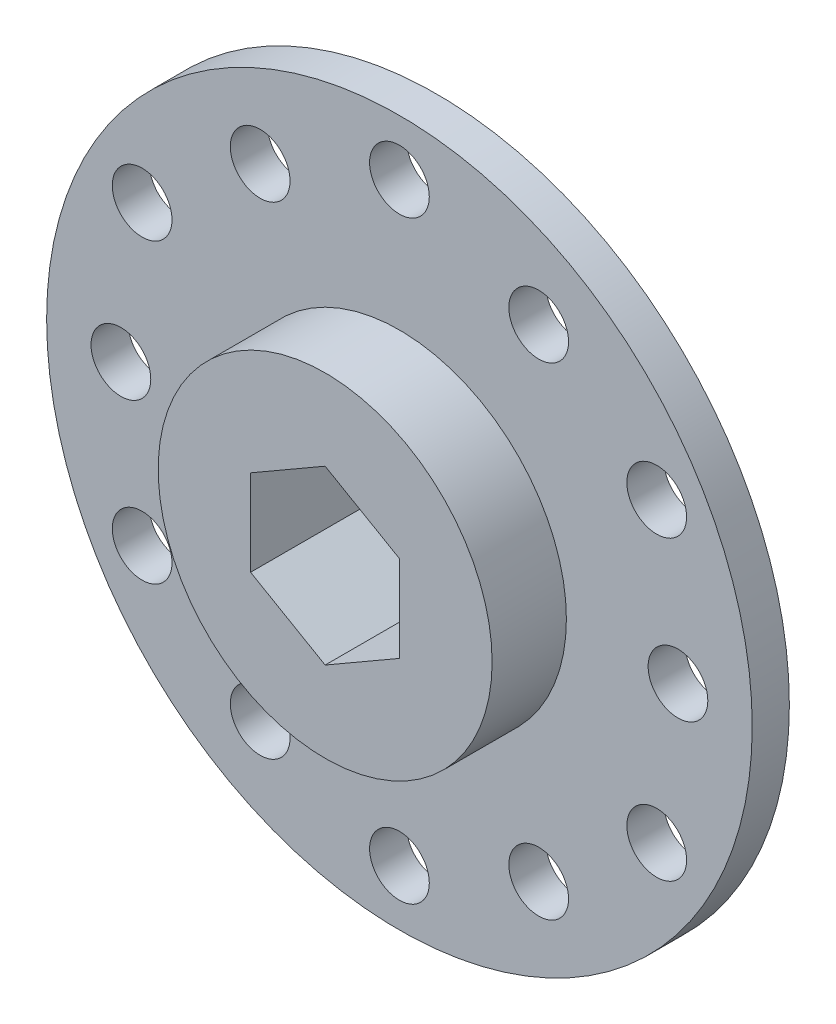
ISO-10303-21;
HEADER;
FILE_DESCRIPTION(('STEP AP214'),'2;1');
FILE_NAME('part.step','',(''),(''),'','','');
FILE_SCHEMA(('AUTOMOTIVE_DESIGN { 1 0 10303 214 1 1 1 1 }'));
ENDSEC;
DATA;
#1=APPLICATION_CONTEXT('core data for automotive mechanical design processes');
#2=APPLICATION_PROTOCOL_DEFINITION('international standard','automotive_design',2000,#1);
#3=PRODUCT_CONTEXT('',#1,'mechanical');
#4=PRODUCT('Part','Part','',(#3));
#5=PRODUCT_RELATED_PRODUCT_CATEGORY('part','',(#4));
#6=PRODUCT_DEFINITION_FORMATION('','',#4);
#7=PRODUCT_DEFINITION_CONTEXT('part definition',#1,'design');
#8=PRODUCT_DEFINITION('design','',#6,#7);
#9=PRODUCT_DEFINITION_SHAPE('','',#8);
#10=(LENGTH_UNIT() NAMED_UNIT(*) SI_UNIT(.MILLI.,.METRE.));
#11=(NAMED_UNIT(*) PLANE_ANGLE_UNIT() SI_UNIT($,.RADIAN.));
#12=(NAMED_UNIT(*) SI_UNIT($,.STERADIAN.) SOLID_ANGLE_UNIT());
#13=UNCERTAINTY_MEASURE_WITH_UNIT(LENGTH_MEASURE(1.E-05),#10,'distance_accuracy_value','');
#14=(GEOMETRIC_REPRESENTATION_CONTEXT(3) GLOBAL_UNCERTAINTY_ASSIGNED_CONTEXT((#13)) GLOBAL_UNIT_ASSIGNED_CONTEXT((#10,
#11,#12)) REPRESENTATION_CONTEXT('',''));
#15=CARTESIAN_POINT('',(0.,0.,0.));
#16=DIRECTION('',(0.,0.,1.));
#17=DIRECTION('',(1.,0.,0.));
#18=AXIS2_PLACEMENT_3D('',#15,#16,#17);
#19=CARTESIAN_POINT('',(0.,0.,0.));
#20=DIRECTION('',(0.,0.,1.));
#21=DIRECTION('',(1.,0.,0.));
#22=AXIS2_PLACEMENT_3D('',#19,#20,#21);
#23=CYLINDRICAL_SURFACE('',#22,30.1625);
#24=CARTESIAN_POINT('',(0.,0.,0.));
#25=DIRECTION('',(0.,0.,1.));
#26=DIRECTION('',(1.,0.,0.));
#27=AXIS2_PLACEMENT_3D('',#24,#25,#26);
#28=CIRCLE('',#27,30.1625);
#29=CARTESIAN_POINT('',(30.1625,0.,0.));
#30=VERTEX_POINT('',#29);
#31=EDGE_CURVE('E54',#30,#30,#28,.T.);
#32=ORIENTED_EDGE('',*,*,#31,.T.);
#33=EDGE_LOOP('',(#32));
#34=FACE_BOUND('',#33,.T.);
#35=CARTESIAN_POINT('',(0.,0.,3.175));
#36=DIRECTION('',(0.,0.,1.));
#37=DIRECTION('',(1.,0.,0.));
#38=AXIS2_PLACEMENT_3D('',#35,#36,#37);
#39=CIRCLE('',#38,30.1625);
#40=CARTESIAN_POINT('',(30.1625,0.,3.175));
#41=VERTEX_POINT('',#40);
#42=EDGE_CURVE('E176',#41,#41,#39,.T.);
#43=ORIENTED_EDGE('',*,*,#42,.F.);
#44=EDGE_LOOP('',(#43));
#45=FACE_BOUND('',#44,.T.);
#46=ADVANCED_FACE('F45',(#34,#45),#23,.T.);
#47=CARTESIAN_POINT('',(30.1625,0.,0.));
#48=DIRECTION('',(0.,0.,-1.));
#49=DIRECTION('',(-1.,0.,0.));
#50=AXIS2_PLACEMENT_3D('',#47,#48,#49);
#51=PLANE('',#50);
#52=CARTESIAN_POINT('',(-11.90625,20.6222299276169,0.));
#53=DIRECTION('',(0.,0.,-1.));
#54=DIRECTION('',(-1.,0.,0.));
#55=AXIS2_PLACEMENT_3D('',#52,#53,#54);
#56=CIRCLE('',#55,2.55270000000001);
#57=CARTESIAN_POINT('',(-14.45895,20.6222299276169,0.));
#58=VERTEX_POINT('',#57);
#59=EDGE_CURVE('E358',#58,#58,#56,.T.);
#60=ORIENTED_EDGE('',*,*,#59,.F.);
#61=EDGE_LOOP('',(#60));
#62=FACE_BOUND('',#61,.T.);
#63=CARTESIAN_POINT('',(0.,25.4,0.));
#64=DIRECTION('',(0.,0.,-1.));
#65=DIRECTION('',(-1.,0.,0.));
#66=AXIS2_PLACEMENT_3D('',#63,#64,#65);
#67=CIRCLE('',#66,2.55270000000001);
#68=CARTESIAN_POINT('',(-2.55270000000001,25.4,0.));
#69=VERTEX_POINT('',#68);
#70=EDGE_CURVE('E362',#69,#69,#67,.T.);
#71=ORIENTED_EDGE('',*,*,#70,.F.);
#72=EDGE_LOOP('',(#71));
#73=FACE_BOUND('',#72,.T.);
#74=CARTESIAN_POINT('',(-23.8125,0.,0.));
#75=DIRECTION('',(0.,0.,-1.));
#76=DIRECTION('',(-1.,0.,0.));
#77=AXIS2_PLACEMENT_3D('',#74,#75,#76);
#78=CIRCLE('',#77,2.55270000000001);
#79=CARTESIAN_POINT('',(-26.3652,0.,0.));
#80=VERTEX_POINT('',#79);
#81=EDGE_CURVE('E372',#80,#80,#78,.T.);
#82=ORIENTED_EDGE('',*,*,#81,.F.);
#83=EDGE_LOOP('',(#82));
#84=FACE_BOUND('',#83,.T.);
#85=CARTESIAN_POINT('',(-21.9970452561247,12.7,0.));
#86=DIRECTION('',(0.,0.,-1.));
#87=DIRECTION('',(-1.,0.,0.));
#88=AXIS2_PLACEMENT_3D('',#85,#86,#87);
#89=CIRCLE('',#88,2.55270000000001);
#90=CARTESIAN_POINT('',(-24.5497452561248,12.7,0.));
#91=VERTEX_POINT('',#90);
#92=EDGE_CURVE('E218',#91,#91,#89,.T.);
#93=ORIENTED_EDGE('',*,*,#92,.F.);
#94=EDGE_LOOP('',(#93));
#95=FACE_BOUND('',#94,.T.);
#96=CARTESIAN_POINT('',(-11.90625,-20.6222299276169,0.));
#97=DIRECTION('',(0.,0.,-1.));
#98=DIRECTION('',(-1.,0.,0.));
#99=AXIS2_PLACEMENT_3D('',#96,#97,#98);
#100=CIRCLE('',#99,2.55270000000001);
#101=CARTESIAN_POINT('',(-14.45895,-20.6222299276169,0.));
#102=VERTEX_POINT('',#101);
#103=EDGE_CURVE('E203',#102,#102,#100,.T.);
#104=ORIENTED_EDGE('',*,*,#103,.F.);
#105=EDGE_LOOP('',(#104));
#106=FACE_BOUND('',#105,.T.);
#107=CARTESIAN_POINT('',(-21.9970452561247,-12.7,0.));
#108=DIRECTION('',(0.,0.,-1.));
#109=DIRECTION('',(-1.,0.,0.));
#110=AXIS2_PLACEMENT_3D('',#107,#108,#109);
#111=CIRCLE('',#110,2.55270000000001);
#112=CARTESIAN_POINT('',(-24.5497452561248,-12.7,0.));
#113=VERTEX_POINT('',#112);
#114=EDGE_CURVE('E202',#113,#113,#111,.T.);
#115=ORIENTED_EDGE('',*,*,#114,.F.);
#116=EDGE_LOOP('',(#115));
#117=FACE_BOUND('',#116,.T.);
#118=CARTESIAN_POINT('',(11.90625,-20.6222299276169,0.));
#119=DIRECTION('',(0.,0.,-1.));
#120=DIRECTION('',(-1.,0.,0.));
#121=AXIS2_PLACEMENT_3D('',#118,#119,#120);
#122=CIRCLE('',#121,2.55270000000001);
#123=CARTESIAN_POINT('',(9.35354999999999,-20.6222299276169,0.));
#124=VERTEX_POINT('',#123);
#125=EDGE_CURVE('E198',#124,#124,#122,.T.);
#126=ORIENTED_EDGE('',*,*,#125,.F.);
#127=EDGE_LOOP('',(#126));
#128=FACE_BOUND('',#127,.T.);
#129=CARTESIAN_POINT('',(0.,-25.4,0.));
#130=DIRECTION('',(0.,0.,-1.));
#131=DIRECTION('',(-1.,0.,0.));
#132=AXIS2_PLACEMENT_3D('',#129,#130,#131);
#133=CIRCLE('',#132,2.55270000000001);
#134=CARTESIAN_POINT('',(-2.55270000000002,-25.4,0.));
#135=VERTEX_POINT('',#134);
#136=EDGE_CURVE('E194',#135,#135,#133,.T.);
#137=ORIENTED_EDGE('',*,*,#136,.F.);
#138=EDGE_LOOP('',(#137));
#139=FACE_BOUND('',#138,.T.);
#140=CARTESIAN_POINT('',(23.8125,0.,0.));
#141=DIRECTION('',(0.,0.,-1.));
#142=DIRECTION('',(-1.,0.,0.));
#143=AXIS2_PLACEMENT_3D('',#140,#141,#142);
#144=CIRCLE('',#143,2.55270000000001);
#145=CARTESIAN_POINT('',(21.2598,0.,0.));
#146=VERTEX_POINT('',#145);
#147=EDGE_CURVE('E189',#146,#146,#144,.T.);
#148=ORIENTED_EDGE('',*,*,#147,.F.);
#149=EDGE_LOOP('',(#148));
#150=FACE_BOUND('',#149,.T.);
#151=CARTESIAN_POINT('',(21.9970452561247,-12.7,0.));
#152=DIRECTION('',(0.,0.,-1.));
#153=DIRECTION('',(-1.,0.,0.));
#154=AXIS2_PLACEMENT_3D('',#151,#152,#153);
#155=CIRCLE('',#154,2.55270000000001);
#156=CARTESIAN_POINT('',(19.4443452561247,-12.7,0.));
#157=VERTEX_POINT('',#156);
#158=EDGE_CURVE('E188',#157,#157,#155,.T.);
#159=ORIENTED_EDGE('',*,*,#158,.F.);
#160=EDGE_LOOP('',(#159));
#161=FACE_BOUND('',#160,.T.);
#162=CARTESIAN_POINT('',(11.90625,20.6222299276169,0.));
#163=DIRECTION('',(0.,0.,-1.));
#164=DIRECTION('',(-1.,0.,0.));
#165=AXIS2_PLACEMENT_3D('',#162,#163,#164);
#166=CIRCLE('',#165,2.55270000000001);
#167=CARTESIAN_POINT('',(9.35354999999999,20.6222299276169,0.));
#168=VERTEX_POINT('',#167);
#169=EDGE_CURVE('E241',#168,#168,#166,.T.);
#170=ORIENTED_EDGE('',*,*,#169,.F.);
#171=EDGE_LOOP('',(#170));
#172=FACE_BOUND('',#171,.T.);
#173=CARTESIAN_POINT('',(21.9970452561247,12.7,0.));
#174=DIRECTION('',(0.,0.,-1.));
#175=DIRECTION('',(-1.,0.,0.));
#176=AXIS2_PLACEMENT_3D('',#173,#174,#175);
#177=CIRCLE('',#176,2.55270000000001);
#178=CARTESIAN_POINT('',(19.4443452561247,12.7,0.));
#179=VERTEX_POINT('',#178);
#180=EDGE_CURVE('E248',#179,#179,#177,.T.);
#181=ORIENTED_EDGE('',*,*,#180,.F.);
#182=EDGE_LOOP('',(#181));
#183=FACE_BOUND('',#182,.T.);
#184=DIRECTION('',(0.866025403784439,-0.5,0.));
#185=VECTOR('',#184,1.);
#186=CARTESIAN_POINT('',(-6.3754,-3.68083890619154,0.));
#187=LINE('',#186,#185);
#188=CARTESIAN_POINT('',(-6.3754,-3.68083890619154,0.));
#189=VERTEX_POINT('',#188);
#190=CARTESIAN_POINT('',(0.,-7.36167781238308,0.));
#191=VERTEX_POINT('',#190);
#192=EDGE_CURVE('E102',#189,#191,#187,.T.);
#193=ORIENTED_EDGE('',*,*,#192,.T.);
#194=DIRECTION('',(0.866025403784439,0.5,0.));
#195=VECTOR('',#194,1.);
#196=CARTESIAN_POINT('',(0.,-7.36167781238308,0.));
#197=LINE('',#196,#195);
#198=CARTESIAN_POINT('',(6.3754,-3.68083890619154,0.));
#199=VERTEX_POINT('',#198);
#200=EDGE_CURVE('E112',#191,#199,#197,.T.);
#201=ORIENTED_EDGE('',*,*,#200,.T.);
#202=DIRECTION('',(0.,1.,0.));
#203=VECTOR('',#202,1.);
#204=CARTESIAN_POINT('',(6.3754,-3.68083890619154,0.));
#205=LINE('',#204,#203);
#206=CARTESIAN_POINT('',(6.3754,3.68083890619154,0.));
#207=VERTEX_POINT('',#206);
#208=EDGE_CURVE('E62',#199,#207,#205,.T.);
#209=ORIENTED_EDGE('',*,*,#208,.T.);
#210=DIRECTION('',(-0.866025403784439,0.5,0.));
#211=VECTOR('',#210,1.);
#212=CARTESIAN_POINT('',(6.3754,3.68083890619154,0.));
#213=LINE('',#212,#211);
#214=CARTESIAN_POINT('',(0.,7.36167781238308,0.));
#215=VERTEX_POINT('',#214);
#216=EDGE_CURVE('E134',#207,#215,#213,.T.);
#217=ORIENTED_EDGE('',*,*,#216,.T.);
#218=DIRECTION('',(-0.866025403784438,-0.500000000000001,0.));
#219=VECTOR('',#218,1.);
#220=CARTESIAN_POINT('',(0.,7.36167781238308,0.));
#221=LINE('',#220,#219);
#222=CARTESIAN_POINT('',(-6.3754,3.68083890619154,0.));
#223=VERTEX_POINT('',#222);
#224=EDGE_CURVE('E138',#215,#223,#221,.T.);
#225=ORIENTED_EDGE('',*,*,#224,.T.);
#226=DIRECTION('',(0.,-1.,0.));
#227=VECTOR('',#226,1.);
#228=CARTESIAN_POINT('',(-6.3754,3.68083890619154,0.));
#229=LINE('',#228,#227);
#230=EDGE_CURVE('E109',#223,#189,#229,.T.);
#231=ORIENTED_EDGE('',*,*,#230,.T.);
#232=EDGE_LOOP('',(#193,#201,#209,#217,#225,#231));
#233=FACE_BOUND('',#232,.T.);
#234=ORIENTED_EDGE('',*,*,#31,.F.);
#235=EDGE_LOOP('',(#234));
#236=FACE_BOUND('',#235,.T.);
#237=ADVANCED_FACE('F117',(#62,#73,#84,#95,#106,#117,#128,#139,#150,#161,#172,#183,#233,#236),
#51,.T.);
#238=CARTESIAN_POINT('',(0.,0.,3.175));
#239=DIRECTION('',(0.,0.,1.));
#240=DIRECTION('',(1.,0.,0.));
#241=AXIS2_PLACEMENT_3D('',#238,#239,#240);
#242=PLANE('',#241);
#243=CARTESIAN_POINT('',(-11.90625,20.6222299276169,3.175));
#244=DIRECTION('',(0.,0.,1.));
#245=DIRECTION('',(1.,0.,0.));
#246=AXIS2_PLACEMENT_3D('',#243,#244,#245);
#247=CIRCLE('',#246,2.55270000000001);
#248=CARTESIAN_POINT('',(-9.35354999999999,20.6222299276169,3.175));
#249=VERTEX_POINT('',#248);
#250=EDGE_CURVE('E356',#249,#249,#247,.T.);
#251=ORIENTED_EDGE('',*,*,#250,.F.);
#252=EDGE_LOOP('',(#251));
#253=FACE_BOUND('',#252,.T.);
#254=CARTESIAN_POINT('',(0.,25.4,3.175));
#255=DIRECTION('',(0.,0.,1.));
#256=DIRECTION('',(1.,0.,0.));
#257=AXIS2_PLACEMENT_3D('',#254,#255,#256);
#258=CIRCLE('',#257,2.55270000000001);
#259=CARTESIAN_POINT('',(2.55270000000001,25.4,3.175));
#260=VERTEX_POINT('',#259);
#261=EDGE_CURVE('E368',#260,#260,#258,.T.);
#262=ORIENTED_EDGE('',*,*,#261,.F.);
#263=EDGE_LOOP('',(#262));
#264=FACE_BOUND('',#263,.T.);
#265=CARTESIAN_POINT('',(-23.8125,0.,3.175));
#266=DIRECTION('',(0.,0.,1.));
#267=DIRECTION('',(1.,0.,0.));
#268=AXIS2_PLACEMENT_3D('',#265,#266,#267);
#269=CIRCLE('',#268,2.55270000000001);
#270=CARTESIAN_POINT('',(-21.2598,0.,3.175));
#271=VERTEX_POINT('',#270);
#272=EDGE_CURVE('E48',#271,#271,#269,.T.);
#273=ORIENTED_EDGE('',*,*,#272,.F.);
#274=EDGE_LOOP('',(#273));
#275=FACE_BOUND('',#274,.T.);
#276=CARTESIAN_POINT('',(-21.9970452561247,12.7,3.175));
#277=DIRECTION('',(0.,0.,1.));
#278=DIRECTION('',(1.,0.,0.));
#279=AXIS2_PLACEMENT_3D('',#276,#277,#278);
#280=CIRCLE('',#279,2.55270000000001);
#281=CARTESIAN_POINT('',(-19.4443452561247,12.7,3.175));
#282=VERTEX_POINT('',#281);
#283=EDGE_CURVE('E212',#282,#282,#280,.T.);
#284=ORIENTED_EDGE('',*,*,#283,.F.);
#285=EDGE_LOOP('',(#284));
#286=FACE_BOUND('',#285,.T.);
#287=CARTESIAN_POINT('',(-11.90625,-20.6222299276169,3.175));
#288=DIRECTION('',(0.,0.,1.));
#289=DIRECTION('',(1.,0.,0.));
#290=AXIS2_PLACEMENT_3D('',#287,#288,#289);
#291=CIRCLE('',#290,2.55270000000001);
#292=CARTESIAN_POINT('',(-9.35354999999999,-20.6222299276169,3.175));
#293=VERTEX_POINT('',#292);
#294=EDGE_CURVE('E199',#293,#293,#291,.T.);
#295=ORIENTED_EDGE('',*,*,#294,.F.);
#296=EDGE_LOOP('',(#295));
#297=FACE_BOUND('',#296,.T.);
#298=CARTESIAN_POINT('',(-21.9970452561247,-12.7,3.175));
#299=DIRECTION('',(0.,0.,1.));
#300=DIRECTION('',(1.,0.,0.));
#301=AXIS2_PLACEMENT_3D('',#298,#299,#300);
#302=CIRCLE('',#301,2.55270000000001);
#303=CARTESIAN_POINT('',(-19.4443452561247,-12.7,3.175));
#304=VERTEX_POINT('',#303);
#305=EDGE_CURVE('E209',#304,#304,#302,.T.);
#306=ORIENTED_EDGE('',*,*,#305,.F.);
#307=EDGE_LOOP('',(#306));
#308=FACE_BOUND('',#307,.T.);
#309=CARTESIAN_POINT('',(11.90625,-20.6222299276169,3.175));
#310=DIRECTION('',(0.,0.,1.));
#311=DIRECTION('',(1.,0.,0.));
#312=AXIS2_PLACEMENT_3D('',#309,#310,#311);
#313=CIRCLE('',#312,2.55270000000001);
#314=CARTESIAN_POINT('',(14.45895,-20.6222299276169,3.175));
#315=VERTEX_POINT('',#314);
#316=EDGE_CURVE('E195',#315,#315,#313,.T.);
#317=ORIENTED_EDGE('',*,*,#316,.F.);
#318=EDGE_LOOP('',(#317));
#319=FACE_BOUND('',#318,.T.);
#320=CARTESIAN_POINT('',(0.,-25.4,3.175));
#321=DIRECTION('',(0.,0.,1.));
#322=DIRECTION('',(1.,0.,0.));
#323=AXIS2_PLACEMENT_3D('',#320,#321,#322);
#324=CIRCLE('',#323,2.55270000000001);
#325=CARTESIAN_POINT('',(2.55270000000001,-25.4,3.175));
#326=VERTEX_POINT('',#325);
#327=EDGE_CURVE('E190',#326,#326,#324,.T.);
#328=ORIENTED_EDGE('',*,*,#327,.F.);
#329=EDGE_LOOP('',(#328));
#330=FACE_BOUND('',#329,.T.);
#331=CARTESIAN_POINT('',(23.8125,0.,3.175));
#332=DIRECTION('',(0.,0.,1.));
#333=DIRECTION('',(1.,0.,0.));
#334=AXIS2_PLACEMENT_3D('',#331,#332,#333);
#335=CIRCLE('',#334,2.55270000000001);
#336=CARTESIAN_POINT('',(26.3652,0.,3.175));
#337=VERTEX_POINT('',#336);
#338=EDGE_CURVE('E184',#337,#337,#335,.T.);
#339=ORIENTED_EDGE('',*,*,#338,.F.);
#340=EDGE_LOOP('',(#339));
#341=FACE_BOUND('',#340,.T.);
#342=CARTESIAN_POINT('',(21.9970452561247,-12.7,3.175));
#343=DIRECTION('',(0.,0.,1.));
#344=DIRECTION('',(1.,0.,0.));
#345=AXIS2_PLACEMENT_3D('',#342,#343,#344);
#346=CIRCLE('',#345,2.55270000000001);
#347=CARTESIAN_POINT('',(24.5497452561248,-12.7,3.175));
#348=VERTEX_POINT('',#347);
#349=EDGE_CURVE('E237',#348,#348,#346,.T.);
#350=ORIENTED_EDGE('',*,*,#349,.F.);
#351=EDGE_LOOP('',(#350));
#352=FACE_BOUND('',#351,.T.);
#353=CARTESIAN_POINT('',(11.90625,20.6222299276169,3.175));
#354=DIRECTION('',(0.,0.,1.));
#355=DIRECTION('',(1.,0.,0.));
#356=AXIS2_PLACEMENT_3D('',#353,#354,#355);
#357=CIRCLE('',#356,2.55270000000001);
#358=CARTESIAN_POINT('',(14.45895,20.6222299276169,3.175));
#359=VERTEX_POINT('',#358);
#360=EDGE_CURVE('E245',#359,#359,#357,.T.);
#361=ORIENTED_EDGE('',*,*,#360,.F.);
#362=EDGE_LOOP('',(#361));
#363=FACE_BOUND('',#362,.T.);
#364=CARTESIAN_POINT('',(21.9970452561247,12.7,3.175));
#365=DIRECTION('',(0.,0.,1.));
#366=DIRECTION('',(1.,0.,0.));
#367=AXIS2_PLACEMENT_3D('',#364,#365,#366);
#368=CIRCLE('',#367,2.55270000000001);
#369=CARTESIAN_POINT('',(24.5497452561248,12.7,3.175));
#370=VERTEX_POINT('',#369);
#371=EDGE_CURVE('E129',#370,#370,#368,.T.);
#372=ORIENTED_EDGE('',*,*,#371,.F.);
#373=EDGE_LOOP('',(#372));
#374=FACE_BOUND('',#373,.T.);
#375=CARTESIAN_POINT('',(0.,0.,3.175));
#376=DIRECTION('',(0.,0.,1.));
#377=DIRECTION('',(1.,0.,0.));
#378=AXIS2_PLACEMENT_3D('',#375,#376,#377);
#379=CIRCLE('',#378,14.2748);
#380=CARTESIAN_POINT('',(14.2748,0.,3.175));
#381=VERTEX_POINT('',#380);
#382=EDGE_CURVE('E11',#381,#381,#379,.T.);
#383=ORIENTED_EDGE('',*,*,#382,.F.);
#384=EDGE_LOOP('',(#383));
#385=FACE_BOUND('',#384,.T.);
#386=ORIENTED_EDGE('',*,*,#42,.T.);
#387=EDGE_LOOP('',(#386));
#388=FACE_BOUND('',#387,.T.);
#389=ADVANCED_FACE('F259',(#253,#264,#275,#286,#297,#308,#319,#330,#341,#352,#363,#374,#385,
#388),#242,.T.);
#390=CARTESIAN_POINT('',(0.,0.,9.525));
#391=DIRECTION('',(0.,0.,-1.));
#392=DIRECTION('',(-1.,0.,0.));
#393=AXIS2_PLACEMENT_3D('',#390,#391,#392);
#394=CYLINDRICAL_SURFACE('',#393,14.2748);
#395=CARTESIAN_POINT('',(0.,0.,9.525));
#396=DIRECTION('',(0.,0.,1.));
#397=DIRECTION('',(1.,0.,0.));
#398=AXIS2_PLACEMENT_3D('',#395,#396,#397);
#399=CIRCLE('',#398,14.2748);
#400=CARTESIAN_POINT('',(14.2748,0.,9.525));
#401=VERTEX_POINT('',#400);
#402=EDGE_CURVE('E162',#401,#401,#399,.T.);
#403=ORIENTED_EDGE('',*,*,#402,.F.);
#404=EDGE_LOOP('',(#403));
#405=FACE_BOUND('',#404,.T.);
#406=ORIENTED_EDGE('',*,*,#382,.T.);
#407=EDGE_LOOP('',(#406));
#408=FACE_BOUND('',#407,.T.);
#409=ADVANCED_FACE('F262',(#405,#408),#394,.T.);
#410=CARTESIAN_POINT('',(0.,0.,9.525));
#411=DIRECTION('',(0.,0.,1.));
#412=DIRECTION('',(1.,0.,0.));
#413=AXIS2_PLACEMENT_3D('',#410,#411,#412);
#414=PLANE('',#413);
#415=DIRECTION('',(0.866025403784439,-0.5,0.));
#416=VECTOR('',#415,1.);
#417=CARTESIAN_POINT('',(-6.3754,-3.68083890619154,9.525));
#418=LINE('',#417,#416);
#419=CARTESIAN_POINT('',(-6.3754,-3.68083890619154,9.525));
#420=VERTEX_POINT('',#419);
#421=CARTESIAN_POINT('',(0.,-7.36167781238308,9.525));
#422=VERTEX_POINT('',#421);
#423=EDGE_CURVE('E70',#420,#422,#418,.T.);
#424=ORIENTED_EDGE('',*,*,#423,.F.);
#425=DIRECTION('',(0.,-1.,0.));
#426=VECTOR('',#425,1.);
#427=CARTESIAN_POINT('',(-6.3754,3.68083890619154,9.525));
#428=LINE('',#427,#426);
#429=CARTESIAN_POINT('',(-6.3754,3.68083890619154,9.525));
#430=VERTEX_POINT('',#429);
#431=EDGE_CURVE('E122',#430,#420,#428,.T.);
#432=ORIENTED_EDGE('',*,*,#431,.F.);
#433=DIRECTION('',(-0.866025403784438,-0.500000000000001,0.));
#434=VECTOR('',#433,1.);
#435=CARTESIAN_POINT('',(0.,7.36167781238308,9.525));
#436=LINE('',#435,#434);
#437=CARTESIAN_POINT('',(0.,7.36167781238308,9.525));
#438=VERTEX_POINT('',#437);
#439=EDGE_CURVE('E126',#438,#430,#436,.T.);
#440=ORIENTED_EDGE('',*,*,#439,.F.);
#441=DIRECTION('',(-0.866025403784439,0.5,0.));
#442=VECTOR('',#441,1.);
#443=CARTESIAN_POINT('',(6.3754,3.68083890619154,9.525));
#444=LINE('',#443,#442);
#445=CARTESIAN_POINT('',(6.3754,3.68083890619154,9.525));
#446=VERTEX_POINT('',#445);
#447=EDGE_CURVE('E152',#446,#438,#444,.T.);
#448=ORIENTED_EDGE('',*,*,#447,.F.);
#449=DIRECTION('',(0.,1.,0.));
#450=VECTOR('',#449,1.);
#451=CARTESIAN_POINT('',(6.3754,-3.68083890619154,9.525));
#452=LINE('',#451,#450);
#453=CARTESIAN_POINT('',(6.3754,-3.68083890619154,9.525));
#454=VERTEX_POINT('',#453);
#455=EDGE_CURVE('E148',#454,#446,#452,.T.);
#456=ORIENTED_EDGE('',*,*,#455,.F.);
#457=DIRECTION('',(0.866025403784439,0.5,0.));
#458=VECTOR('',#457,1.);
#459=CARTESIAN_POINT('',(0.,-7.36167781238308,9.525));
#460=LINE('',#459,#458);
#461=EDGE_CURVE('E145',#422,#454,#460,.T.);
#462=ORIENTED_EDGE('',*,*,#461,.F.);
#463=EDGE_LOOP('',(#424,#432,#440,#448,#456,#462));
#464=FACE_BOUND('',#463,.T.);
#465=ORIENTED_EDGE('',*,*,#402,.T.);
#466=EDGE_LOOP('',(#465));
#467=FACE_BOUND('',#466,.T.);
#468=ADVANCED_FACE('F284',(#464,#467),#414,.T.);
#469=CARTESIAN_POINT('',(-6.3754,-3.68083890619154,0.));
#470=DIRECTION('',(-0.5,-0.866025403784439,0.));
#471=DIRECTION('',(0.866025403784438,-0.5,0.));
#472=AXIS2_PLACEMENT_3D('',#469,#470,#471);
#473=PLANE('',#472);
#474=ORIENTED_EDGE('',*,*,#423,.T.);
#475=DIRECTION('',(0.,0.,1.));
#476=VECTOR('',#475,1.);
#477=CARTESIAN_POINT('',(0.,-7.36167781238308,0.));
#478=LINE('',#477,#476);
#479=EDGE_CURVE('E98',#191,#422,#478,.T.);
#480=ORIENTED_EDGE('',*,*,#479,.F.);
#481=ORIENTED_EDGE('',*,*,#192,.F.);
#482=DIRECTION('',(0.,0.,1.));
#483=VECTOR('',#482,1.);
#484=CARTESIAN_POINT('',(-6.3754,-3.68083890619154,0.));
#485=LINE('',#484,#483);
#486=EDGE_CURVE('E159',#189,#420,#485,.T.);
#487=ORIENTED_EDGE('',*,*,#486,.T.);
#488=EDGE_LOOP('',(#474,#480,#481,#487));
#489=FACE_BOUND('',#488,.T.);
#490=ADVANCED_FACE('F100',(#489),#473,.F.);
#491=CARTESIAN_POINT('',(-6.3754,3.68083890619154,0.));
#492=DIRECTION('',(-1.,0.,0.));
#493=DIRECTION('',(0.,0.,1.));
#494=AXIS2_PLACEMENT_3D('',#491,#492,#493);
#495=PLANE('',#494);
#496=ORIENTED_EDGE('',*,*,#431,.T.);
#497=ORIENTED_EDGE('',*,*,#486,.F.);
#498=ORIENTED_EDGE('',*,*,#230,.F.);
#499=DIRECTION('',(0.,0.,1.));
#500=VECTOR('',#499,1.);
#501=CARTESIAN_POINT('',(-6.3754,3.68083890619154,0.));
#502=LINE('',#501,#500);
#503=EDGE_CURVE('E163',#223,#430,#502,.T.);
#504=ORIENTED_EDGE('',*,*,#503,.T.);
#505=EDGE_LOOP('',(#496,#497,#498,#504));
#506=FACE_BOUND('',#505,.T.);
#507=ADVANCED_FACE('F291',(#506),#495,.F.);
#508=CARTESIAN_POINT('',(0.,7.36167781238308,0.));
#509=DIRECTION('',(-0.500000000000001,0.866025403784438,0.));
#510=DIRECTION('',(-0.866025403784438,-0.500000000000001,0.));
#511=AXIS2_PLACEMENT_3D('',#508,#509,#510);
#512=PLANE('',#511);
#513=ORIENTED_EDGE('',*,*,#439,.T.);
#514=ORIENTED_EDGE('',*,*,#503,.F.);
#515=ORIENTED_EDGE('',*,*,#224,.F.);
#516=DIRECTION('',(0.,0.,1.));
#517=VECTOR('',#516,1.);
#518=CARTESIAN_POINT('',(0.,7.36167781238308,0.));
#519=LINE('',#518,#517);
#520=EDGE_CURVE('E166',#215,#438,#519,.T.);
#521=ORIENTED_EDGE('',*,*,#520,.T.);
#522=EDGE_LOOP('',(#513,#514,#515,#521));
#523=FACE_BOUND('',#522,.T.);
#524=ADVANCED_FACE('F299',(#523),#512,.F.);
#525=CARTESIAN_POINT('',(6.3754,3.68083890619154,0.));
#526=DIRECTION('',(0.5,0.866025403784439,0.));
#527=DIRECTION('',(-0.866025403784439,0.5,0.));
#528=AXIS2_PLACEMENT_3D('',#525,#526,#527);
#529=PLANE('',#528);
#530=ORIENTED_EDGE('',*,*,#447,.T.);
#531=ORIENTED_EDGE('',*,*,#520,.F.);
#532=ORIENTED_EDGE('',*,*,#216,.F.);
#533=DIRECTION('',(0.,0.,1.));
#534=VECTOR('',#533,1.);
#535=CARTESIAN_POINT('',(6.3754,3.68083890619154,0.));
#536=LINE('',#535,#534);
#537=EDGE_CURVE('E169',#207,#446,#536,.T.);
#538=ORIENTED_EDGE('',*,*,#537,.T.);
#539=EDGE_LOOP('',(#530,#531,#532,#538));
#540=FACE_BOUND('',#539,.T.);
#541=ADVANCED_FACE('F296',(#540),#529,.F.);
#542=CARTESIAN_POINT('',(6.3754,-3.68083890619154,0.));
#543=DIRECTION('',(1.,0.,0.));
#544=DIRECTION('',(0.,0.,-1.));
#545=AXIS2_PLACEMENT_3D('',#542,#543,#544);
#546=PLANE('',#545);
#547=ORIENTED_EDGE('',*,*,#455,.T.);
#548=ORIENTED_EDGE('',*,*,#537,.F.);
#549=ORIENTED_EDGE('',*,*,#208,.F.);
#550=DIRECTION('',(0.,0.,1.));
#551=VECTOR('',#550,1.);
#552=CARTESIAN_POINT('',(6.3754,-3.68083890619154,0.));
#553=LINE('',#552,#551);
#554=EDGE_CURVE('E108',#199,#454,#553,.T.);
#555=ORIENTED_EDGE('',*,*,#554,.T.);
#556=EDGE_LOOP('',(#547,#548,#549,#555));
#557=FACE_BOUND('',#556,.T.);
#558=ADVANCED_FACE('F293',(#557),#546,.F.);
#559=CARTESIAN_POINT('',(0.,-7.36167781238308,0.));
#560=DIRECTION('',(0.5,-0.866025403784439,0.));
#561=DIRECTION('',(0.866025403784439,0.5,0.));
#562=AXIS2_PLACEMENT_3D('',#559,#560,#561);
#563=PLANE('',#562);
#564=ORIENTED_EDGE('',*,*,#461,.T.);
#565=ORIENTED_EDGE('',*,*,#554,.F.);
#566=ORIENTED_EDGE('',*,*,#200,.F.);
#567=ORIENTED_EDGE('',*,*,#479,.T.);
#568=EDGE_LOOP('',(#564,#565,#566,#567));
#569=FACE_BOUND('',#568,.T.);
#570=ADVANCED_FACE('F113',(#569),#563,.F.);
#571=CARTESIAN_POINT('',(21.9970452561247,12.7,0.));
#572=DIRECTION('',(0.,0.,-1.));
#573=DIRECTION('',(-1.,0.,0.));
#574=AXIS2_PLACEMENT_3D('',#571,#572,#573);
#575=CYLINDRICAL_SURFACE('',#574,2.55270000000001);
#576=ORIENTED_EDGE('',*,*,#371,.T.);
#577=EDGE_LOOP('',(#576));
#578=FACE_BOUND('',#577,.T.);
#579=ORIENTED_EDGE('',*,*,#180,.T.);
#580=EDGE_LOOP('',(#579));
#581=FACE_BOUND('',#580,.T.);
#582=ADVANCED_FACE('F257',(#578,#581),#575,.F.);
#583=CARTESIAN_POINT('',(11.90625,20.6222299276169,0.));
#584=DIRECTION('',(0.,0.,-1.));
#585=DIRECTION('',(-1.,0.,0.));
#586=AXIS2_PLACEMENT_3D('',#583,#584,#585);
#587=CYLINDRICAL_SURFACE('',#586,2.55270000000001);
#588=ORIENTED_EDGE('',*,*,#360,.T.);
#589=EDGE_LOOP('',(#588));
#590=FACE_BOUND('',#589,.T.);
#591=ORIENTED_EDGE('',*,*,#169,.T.);
#592=EDGE_LOOP('',(#591));
#593=FACE_BOUND('',#592,.T.);
#594=ADVANCED_FACE('F309',(#590,#593),#587,.F.);
#595=CARTESIAN_POINT('',(21.9970452561247,-12.7,0.));
#596=DIRECTION('',(0.,0.,-1.));
#597=DIRECTION('',(-1.,0.,0.));
#598=AXIS2_PLACEMENT_3D('',#595,#596,#597);
#599=CYLINDRICAL_SURFACE('',#598,2.55270000000001);
#600=ORIENTED_EDGE('',*,*,#349,.T.);
#601=EDGE_LOOP('',(#600));
#602=FACE_BOUND('',#601,.T.);
#603=ORIENTED_EDGE('',*,*,#158,.T.);
#604=EDGE_LOOP('',(#603));
#605=FACE_BOUND('',#604,.T.);
#606=ADVANCED_FACE('F312',(#602,#605),#599,.F.);
#607=CARTESIAN_POINT('',(23.8125,0.,0.));
#608=DIRECTION('',(0.,0.,-1.));
#609=DIRECTION('',(-1.,0.,0.));
#610=AXIS2_PLACEMENT_3D('',#607,#608,#609);
#611=CYLINDRICAL_SURFACE('',#610,2.55270000000001);
#612=ORIENTED_EDGE('',*,*,#338,.T.);
#613=EDGE_LOOP('',(#612));
#614=FACE_BOUND('',#613,.T.);
#615=ORIENTED_EDGE('',*,*,#147,.T.);
#616=EDGE_LOOP('',(#615));
#617=FACE_BOUND('',#616,.T.);
#618=ADVANCED_FACE('F316',(#614,#617),#611,.F.);
#619=CARTESIAN_POINT('',(0.,-25.4,0.));
#620=DIRECTION('',(0.,0.,-1.));
#621=DIRECTION('',(-1.,0.,0.));
#622=AXIS2_PLACEMENT_3D('',#619,#620,#621);
#623=CYLINDRICAL_SURFACE('',#622,2.55270000000001);
#624=ORIENTED_EDGE('',*,*,#327,.T.);
#625=EDGE_LOOP('',(#624));
#626=FACE_BOUND('',#625,.T.);
#627=ORIENTED_EDGE('',*,*,#136,.T.);
#628=EDGE_LOOP('',(#627));
#629=FACE_BOUND('',#628,.T.);
#630=ADVANCED_FACE('F320',(#626,#629),#623,.F.);
#631=CARTESIAN_POINT('',(11.90625,-20.6222299276169,0.));
#632=DIRECTION('',(0.,0.,-1.));
#633=DIRECTION('',(-1.,0.,0.));
#634=AXIS2_PLACEMENT_3D('',#631,#632,#633);
#635=CYLINDRICAL_SURFACE('',#634,2.55270000000001);
#636=ORIENTED_EDGE('',*,*,#316,.T.);
#637=EDGE_LOOP('',(#636));
#638=FACE_BOUND('',#637,.T.);
#639=ORIENTED_EDGE('',*,*,#125,.T.);
#640=EDGE_LOOP('',(#639));
#641=FACE_BOUND('',#640,.T.);
#642=ADVANCED_FACE('F324',(#638,#641),#635,.F.);
#643=CARTESIAN_POINT('',(-21.9970452561247,-12.7,0.));
#644=DIRECTION('',(0.,0.,-1.));
#645=DIRECTION('',(-1.,0.,0.));
#646=AXIS2_PLACEMENT_3D('',#643,#644,#645);
#647=CYLINDRICAL_SURFACE('',#646,2.55270000000001);
#648=ORIENTED_EDGE('',*,*,#305,.T.);
#649=EDGE_LOOP('',(#648));
#650=FACE_BOUND('',#649,.T.);
#651=ORIENTED_EDGE('',*,*,#114,.T.);
#652=EDGE_LOOP('',(#651));
#653=FACE_BOUND('',#652,.T.);
#654=ADVANCED_FACE('F328',(#650,#653),#647,.F.);
#655=CARTESIAN_POINT('',(-11.90625,-20.6222299276169,0.));
#656=DIRECTION('',(0.,0.,-1.));
#657=DIRECTION('',(-1.,0.,0.));
#658=AXIS2_PLACEMENT_3D('',#655,#656,#657);
#659=CYLINDRICAL_SURFACE('',#658,2.55270000000001);
#660=ORIENTED_EDGE('',*,*,#294,.T.);
#661=EDGE_LOOP('',(#660));
#662=FACE_BOUND('',#661,.T.);
#663=ORIENTED_EDGE('',*,*,#103,.T.);
#664=EDGE_LOOP('',(#663));
#665=FACE_BOUND('',#664,.T.);
#666=ADVANCED_FACE('F332',(#662,#665),#659,.F.);
#667=CARTESIAN_POINT('',(-21.9970452561247,12.7,0.));
#668=DIRECTION('',(0.,0.,-1.));
#669=DIRECTION('',(-1.,0.,0.));
#670=AXIS2_PLACEMENT_3D('',#667,#668,#669);
#671=CYLINDRICAL_SURFACE('',#670,2.55270000000001);
#672=ORIENTED_EDGE('',*,*,#283,.T.);
#673=EDGE_LOOP('',(#672));
#674=FACE_BOUND('',#673,.T.);
#675=ORIENTED_EDGE('',*,*,#92,.T.);
#676=EDGE_LOOP('',(#675));
#677=FACE_BOUND('',#676,.T.);
#678=ADVANCED_FACE('F336',(#674,#677),#671,.F.);
#679=CARTESIAN_POINT('',(-23.8125,0.,0.));
#680=DIRECTION('',(0.,0.,-1.));
#681=DIRECTION('',(-1.,0.,0.));
#682=AXIS2_PLACEMENT_3D('',#679,#680,#681);
#683=CYLINDRICAL_SURFACE('',#682,2.55270000000001);
#684=ORIENTED_EDGE('',*,*,#272,.T.);
#685=EDGE_LOOP('',(#684));
#686=FACE_BOUND('',#685,.T.);
#687=ORIENTED_EDGE('',*,*,#81,.T.);
#688=EDGE_LOOP('',(#687));
#689=FACE_BOUND('',#688,.T.);
#690=ADVANCED_FACE('F339',(#686,#689),#683,.F.);
#691=CARTESIAN_POINT('',(0.,25.4,0.));
#692=DIRECTION('',(0.,0.,-1.));
#693=DIRECTION('',(-1.,0.,0.));
#694=AXIS2_PLACEMENT_3D('',#691,#692,#693);
#695=CYLINDRICAL_SURFACE('',#694,2.55270000000001);
#696=ORIENTED_EDGE('',*,*,#261,.T.);
#697=EDGE_LOOP('',(#696));
#698=FACE_BOUND('',#697,.T.);
#699=ORIENTED_EDGE('',*,*,#70,.T.);
#700=EDGE_LOOP('',(#699));
#701=FACE_BOUND('',#700,.T.);
#702=ADVANCED_FACE('F343',(#698,#701),#695,.F.);
#703=CARTESIAN_POINT('',(-11.90625,20.6222299276169,0.));
#704=DIRECTION('',(0.,0.,-1.));
#705=DIRECTION('',(-1.,0.,0.));
#706=AXIS2_PLACEMENT_3D('',#703,#704,#705);
#707=CYLINDRICAL_SURFACE('',#706,2.55270000000001);
#708=ORIENTED_EDGE('',*,*,#250,.T.);
#709=EDGE_LOOP('',(#708));
#710=FACE_BOUND('',#709,.T.);
#711=ORIENTED_EDGE('',*,*,#59,.T.);
#712=EDGE_LOOP('',(#711));
#713=FACE_BOUND('',#712,.T.);
#714=ADVANCED_FACE('F347',(#710,#713),#707,.F.);
#715=CLOSED_SHELL('',(#46,#237,#389,#409,#468,#490,#507,#524,#541,#558,#570,#582,#594,#606,#618,
#630,#642,#654,#666,#678,#690,#702,#714));
#716=MANIFOLD_SOLID_BREP('B2',#715);
#717=ADVANCED_BREP_SHAPE_REPRESENTATION('',(#18,#716),#14);
#718=SHAPE_DEFINITION_REPRESENTATION(#9,#717);
ENDSEC;
END-ISO-10303-21;
